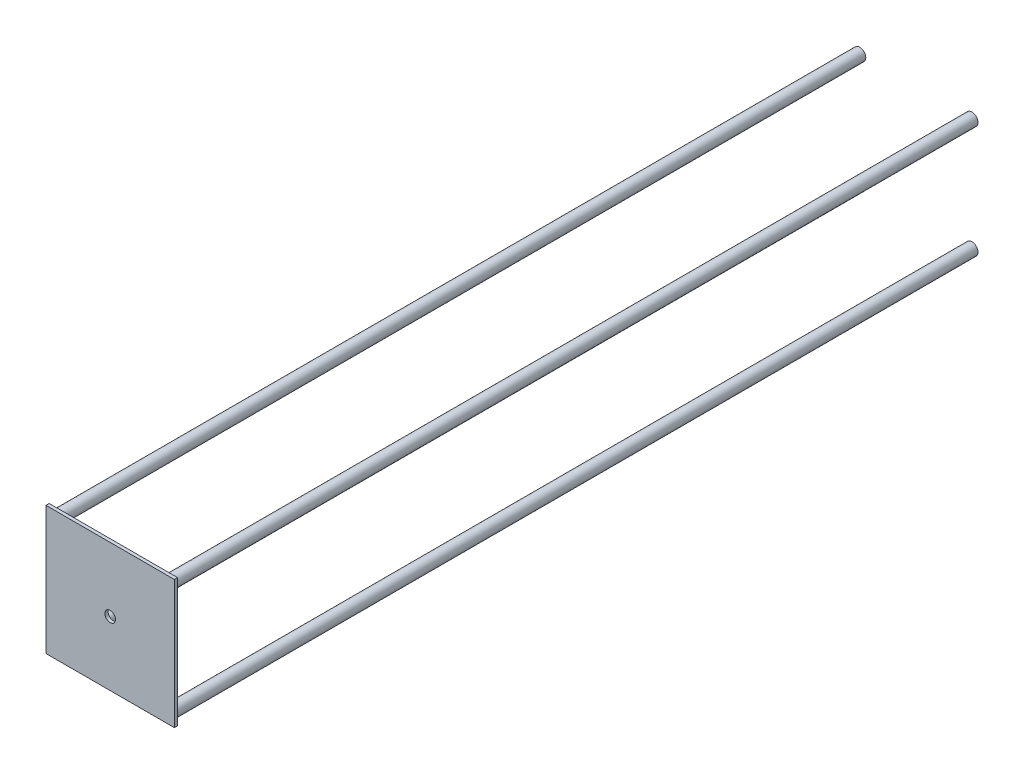
ISO-10303-21;
HEADER;
FILE_DESCRIPTION(('STEP AP214'),'2;1');
FILE_NAME('part.step','',(''),(''),'','','');
FILE_SCHEMA(('AUTOMOTIVE_DESIGN { 1 0 10303 214 1 1 1 1 }'));
ENDSEC;
DATA;
#1=APPLICATION_CONTEXT('core data for automotive mechanical design processes');
#2=APPLICATION_PROTOCOL_DEFINITION('international standard','automotive_design',2000,#1);
#3=PRODUCT_CONTEXT('',#1,'mechanical');
#4=PRODUCT('Part','Part','',(#3));
#5=PRODUCT_RELATED_PRODUCT_CATEGORY('part','',(#4));
#6=PRODUCT_DEFINITION_FORMATION('','',#4);
#7=PRODUCT_DEFINITION_CONTEXT('part definition',#1,'design');
#8=PRODUCT_DEFINITION('design','',#6,#7);
#9=PRODUCT_DEFINITION_SHAPE('','',#8);
#10=(LENGTH_UNIT() NAMED_UNIT(*) SI_UNIT(.MILLI.,.METRE.));
#11=(NAMED_UNIT(*) PLANE_ANGLE_UNIT() SI_UNIT($,.RADIAN.));
#12=(NAMED_UNIT(*) SI_UNIT($,.STERADIAN.) SOLID_ANGLE_UNIT());
#13=UNCERTAINTY_MEASURE_WITH_UNIT(LENGTH_MEASURE(1.E-05),#10,'distance_accuracy_value','');
#14=(GEOMETRIC_REPRESENTATION_CONTEXT(3) GLOBAL_UNCERTAINTY_ASSIGNED_CONTEXT((#13)) GLOBAL_UNIT_ASSIGNED_CONTEXT((#10,
#11,#12)) REPRESENTATION_CONTEXT('',''));
#15=CARTESIAN_POINT('',(0.,0.,0.));
#16=DIRECTION('',(0.,0.,1.));
#17=DIRECTION('',(1.,0.,0.));
#18=AXIS2_PLACEMENT_3D('',#15,#16,#17);
#19=CARTESIAN_POINT('',(50.8,-50.8,2.54));
#20=DIRECTION('',(-1.,0.,0.));
#21=DIRECTION('',(0.,0.,1.));
#22=AXIS2_PLACEMENT_3D('',#19,#20,#21);
#23=PLANE('',#22);
#24=DIRECTION('',(0.,1.,0.));
#25=VECTOR('',#24,1.);
#26=CARTESIAN_POINT('',(50.8,-50.8,0.));
#27=LINE('',#26,#25);
#28=CARTESIAN_POINT('',(50.8,-50.8,0.));
#29=VERTEX_POINT('',#28);
#30=CARTESIAN_POINT('',(50.8,50.8,0.));
#31=VERTEX_POINT('',#30);
#32=EDGE_CURVE('E98',#29,#31,#27,.T.);
#33=ORIENTED_EDGE('',*,*,#32,.T.);
#34=DIRECTION('',(0.,0.,-1.));
#35=VECTOR('',#34,1.);
#36=CARTESIAN_POINT('',(50.8,50.8,2.54));
#37=LINE('',#36,#35);
#38=CARTESIAN_POINT('',(50.8,50.8,2.54));
#39=VERTEX_POINT('',#38);
#40=EDGE_CURVE('E11',#39,#31,#37,.T.);
#41=ORIENTED_EDGE('',*,*,#40,.F.);
#42=DIRECTION('',(0.,1.,0.));
#43=VECTOR('',#42,1.);
#44=CARTESIAN_POINT('',(50.8,-50.8,2.54));
#45=LINE('',#44,#43);
#46=CARTESIAN_POINT('',(50.8,-50.8,2.54));
#47=VERTEX_POINT('',#46);
#48=EDGE_CURVE('E85',#47,#39,#45,.T.);
#49=ORIENTED_EDGE('',*,*,#48,.F.);
#50=DIRECTION('',(0.,0.,-1.));
#51=VECTOR('',#50,1.);
#52=CARTESIAN_POINT('',(50.8,-50.8,2.54));
#53=LINE('',#52,#51);
#54=EDGE_CURVE('E94',#47,#29,#53,.T.);
#55=ORIENTED_EDGE('',*,*,#54,.T.);
#56=EDGE_LOOP('',(#33,#41,#49,#55));
#57=FACE_BOUND('',#56,.T.);
#58=ADVANCED_FACE('F33',(#57),#23,.F.);
#59=CARTESIAN_POINT('',(-50.8,50.8,2.54));
#60=DIRECTION('',(0.,-1.,0.));
#61=DIRECTION('',(0.,0.,-1.));
#62=AXIS2_PLACEMENT_3D('',#59,#60,#61);
#63=PLANE('',#62);
#64=DIRECTION('',(-1.,0.,0.));
#65=VECTOR('',#64,1.);
#66=CARTESIAN_POINT('',(-50.8,50.8,0.));
#67=LINE('',#66,#65);
#68=CARTESIAN_POINT('',(-50.8,50.8,0.));
#69=VERTEX_POINT('',#68);
#70=EDGE_CURVE('E89',#31,#69,#67,.T.);
#71=ORIENTED_EDGE('',*,*,#70,.T.);
#72=DIRECTION('',(0.,0.,-1.));
#73=VECTOR('',#72,1.);
#74=CARTESIAN_POINT('',(-50.8,50.8,2.54));
#75=LINE('',#74,#73);
#76=CARTESIAN_POINT('',(-50.8,50.8,2.54));
#77=VERTEX_POINT('',#76);
#78=EDGE_CURVE('E42',#77,#69,#75,.T.);
#79=ORIENTED_EDGE('',*,*,#78,.F.);
#80=DIRECTION('',(-1.,0.,0.));
#81=VECTOR('',#80,1.);
#82=CARTESIAN_POINT('',(-50.8,50.8,2.54));
#83=LINE('',#82,#81);
#84=EDGE_CURVE('E80',#39,#77,#83,.T.);
#85=ORIENTED_EDGE('',*,*,#84,.F.);
#86=ORIENTED_EDGE('',*,*,#40,.T.);
#87=EDGE_LOOP('',(#71,#79,#85,#86));
#88=FACE_BOUND('',#87,.T.);
#89=ADVANCED_FACE('F88',(#88),#63,.F.);
#90=CARTESIAN_POINT('',(-50.8,-50.8,2.54));
#91=DIRECTION('',(1.,0.,0.));
#92=DIRECTION('',(0.,0.,-1.));
#93=AXIS2_PLACEMENT_3D('',#90,#91,#92);
#94=PLANE('',#93);
#95=DIRECTION('',(0.,-1.,0.));
#96=VECTOR('',#95,1.);
#97=CARTESIAN_POINT('',(-50.8,-50.8,0.));
#98=LINE('',#97,#96);
#99=CARTESIAN_POINT('',(-50.8,-50.8,0.));
#100=VERTEX_POINT('',#99);
#101=EDGE_CURVE('E67',#69,#100,#98,.T.);
#102=ORIENTED_EDGE('',*,*,#101,.T.);
#103=DIRECTION('',(0.,0.,-1.));
#104=VECTOR('',#103,1.);
#105=CARTESIAN_POINT('',(-50.8,-50.8,2.54));
#106=LINE('',#105,#104);
#107=CARTESIAN_POINT('',(-50.8,-50.8,2.54));
#108=VERTEX_POINT('',#107);
#109=EDGE_CURVE('E90',#108,#100,#106,.T.);
#110=ORIENTED_EDGE('',*,*,#109,.F.);
#111=DIRECTION('',(0.,-1.,0.));
#112=VECTOR('',#111,1.);
#113=CARTESIAN_POINT('',(-50.8,-50.8,2.54));
#114=LINE('',#113,#112);
#115=EDGE_CURVE('E83',#77,#108,#114,.T.);
#116=ORIENTED_EDGE('',*,*,#115,.F.);
#117=ORIENTED_EDGE('',*,*,#78,.T.);
#118=EDGE_LOOP('',(#102,#110,#116,#117));
#119=FACE_BOUND('',#118,.T.);
#120=ADVANCED_FACE('F92',(#119),#94,.F.);
#121=CARTESIAN_POINT('',(-50.8,-50.8,2.54));
#122=DIRECTION('',(0.,1.,0.));
#123=DIRECTION('',(0.,0.,1.));
#124=AXIS2_PLACEMENT_3D('',#121,#122,#123);
#125=PLANE('',#124);
#126=DIRECTION('',(1.,0.,0.));
#127=VECTOR('',#126,1.);
#128=CARTESIAN_POINT('',(-50.8,-50.8,0.));
#129=LINE('',#128,#127);
#130=EDGE_CURVE('E73',#100,#29,#129,.T.);
#131=ORIENTED_EDGE('',*,*,#130,.T.);
#132=ORIENTED_EDGE('',*,*,#54,.F.);
#133=DIRECTION('',(1.,0.,0.));
#134=VECTOR('',#133,1.);
#135=CARTESIAN_POINT('',(-50.8,-50.8,2.54));
#136=LINE('',#135,#134);
#137=EDGE_CURVE('E50',#108,#47,#136,.T.);
#138=ORIENTED_EDGE('',*,*,#137,.F.);
#139=ORIENTED_EDGE('',*,*,#109,.T.);
#140=EDGE_LOOP('',(#131,#132,#138,#139));
#141=FACE_BOUND('',#140,.T.);
#142=ADVANCED_FACE('F106',(#141),#125,.F.);
#143=CARTESIAN_POINT('',(0.,0.,2.54));
#144=DIRECTION('',(0.,0.,-1.));
#145=DIRECTION('',(-1.,0.,0.));
#146=AXIS2_PLACEMENT_3D('',#143,#144,#145);
#147=PLANE('',#146);
#148=CARTESIAN_POINT('',(0.,0.,2.54));
#149=DIRECTION('',(0.,0.,1.));
#150=DIRECTION('',(1.,0.,0.));
#151=AXIS2_PLACEMENT_3D('',#148,#149,#150);
#152=CIRCLE('',#151,4.191);
#153=CARTESIAN_POINT('',(4.191,0.,2.54));
#154=VERTEX_POINT('',#153);
#155=EDGE_CURVE('E135',#154,#154,#152,.T.);
#156=ORIENTED_EDGE('',*,*,#155,.F.);
#157=EDGE_LOOP('',(#156));
#158=FACE_BOUND('',#157,.T.);
#159=ORIENTED_EDGE('',*,*,#48,.T.);
#160=ORIENTED_EDGE('',*,*,#84,.T.);
#161=ORIENTED_EDGE('',*,*,#115,.T.);
#162=ORIENTED_EDGE('',*,*,#137,.T.);
#163=EDGE_LOOP('',(#159,#160,#161,#162));
#164=FACE_BOUND('',#163,.T.);
#165=ADVANCED_FACE('F81',(#158,#164),#147,.F.);
#166=CARTESIAN_POINT('',(0.,0.,0.));
#167=DIRECTION('',(0.,0.,-1.));
#168=DIRECTION('',(-1.,0.,0.));
#169=AXIS2_PLACEMENT_3D('',#166,#167,#168);
#170=PLANE('',#169);
#171=CARTESIAN_POINT('',(0.,0.,0.));
#172=DIRECTION('',(0.,0.,-1.));
#173=DIRECTION('',(-1.,0.,0.));
#174=AXIS2_PLACEMENT_3D('',#171,#172,#173);
#175=CIRCLE('',#174,4.191);
#176=CARTESIAN_POINT('',(-4.191,0.,0.));
#177=VERTEX_POINT('',#176);
#178=EDGE_CURVE('E36',#177,#177,#175,.T.);
#179=ORIENTED_EDGE('',*,*,#178,.F.);
#180=EDGE_LOOP('',(#179));
#181=FACE_BOUND('',#180,.T.);
#182=CARTESIAN_POINT('',(-44.3772909723315,44.45,0.));
#183=DIRECTION('',(0.,0.,-1.));
#184=DIRECTION('',(-1.,0.,0.));
#185=AXIS2_PLACEMENT_3D('',#182,#183,#184);
#186=CIRCLE('',#185,4.826);
#187=CARTESIAN_POINT('',(-49.2032909723314,44.45,0.));
#188=VERTEX_POINT('',#187);
#189=EDGE_CURVE('E127',#188,#188,#186,.T.);
#190=ORIENTED_EDGE('',*,*,#189,.F.);
#191=EDGE_LOOP('',(#190));
#192=FACE_BOUND('',#191,.T.);
#193=CARTESIAN_POINT('',(44.45,44.45,0.));
#194=DIRECTION('',(0.,0.,-1.));
#195=DIRECTION('',(-1.,0.,0.));
#196=AXIS2_PLACEMENT_3D('',#193,#194,#195);
#197=CIRCLE('',#196,4.826);
#198=CARTESIAN_POINT('',(39.624,44.45,0.));
#199=VERTEX_POINT('',#198);
#200=EDGE_CURVE('E121',#199,#199,#197,.T.);
#201=ORIENTED_EDGE('',*,*,#200,.F.);
#202=EDGE_LOOP('',(#201));
#203=FACE_BOUND('',#202,.T.);
#204=CARTESIAN_POINT('',(44.45,-44.45,0.));
#205=DIRECTION('',(0.,0.,-1.));
#206=DIRECTION('',(-1.,0.,0.));
#207=AXIS2_PLACEMENT_3D('',#204,#205,#206);
#208=CIRCLE('',#207,4.826);
#209=CARTESIAN_POINT('',(39.624,-44.45,0.));
#210=VERTEX_POINT('',#209);
#211=EDGE_CURVE('E115',#210,#210,#208,.T.);
#212=ORIENTED_EDGE('',*,*,#211,.F.);
#213=EDGE_LOOP('',(#212));
#214=FACE_BOUND('',#213,.T.);
#215=CARTESIAN_POINT('',(-44.3772909723315,-44.45,0.));
#216=DIRECTION('',(0.,0.,-1.));
#217=DIRECTION('',(-1.,0.,0.));
#218=AXIS2_PLACEMENT_3D('',#215,#216,#217);
#219=CIRCLE('',#218,4.826);
#220=CARTESIAN_POINT('',(-49.2032909723314,-44.45,0.));
#221=VERTEX_POINT('',#220);
#222=EDGE_CURVE('E112',#221,#221,#219,.T.);
#223=ORIENTED_EDGE('',*,*,#222,.F.);
#224=EDGE_LOOP('',(#223));
#225=FACE_BOUND('',#224,.T.);
#226=ORIENTED_EDGE('',*,*,#32,.F.);
#227=ORIENTED_EDGE('',*,*,#130,.F.);
#228=ORIENTED_EDGE('',*,*,#101,.F.);
#229=ORIENTED_EDGE('',*,*,#70,.F.);
#230=EDGE_LOOP('',(#226,#227,#228,#229));
#231=FACE_BOUND('',#230,.T.);
#232=ADVANCED_FACE('F109',(#181,#192,#203,#214,#225,#231),#170,.T.);
#233=CARTESIAN_POINT('',(-44.3772909723315,-44.45,-635.));
#234=DIRECTION('',(0.,0.,1.));
#235=DIRECTION('',(1.,0.,0.));
#236=AXIS2_PLACEMENT_3D('',#233,#234,#235);
#237=CYLINDRICAL_SURFACE('',#236,4.826);
#238=CARTESIAN_POINT('',(-44.3772909723315,-44.45,-635.));
#239=DIRECTION('',(0.,0.,-1.));
#240=DIRECTION('',(-1.,0.,0.));
#241=AXIS2_PLACEMENT_3D('',#238,#239,#240);
#242=CIRCLE('',#241,4.826);
#243=CARTESIAN_POINT('',(-49.2032909723314,-44.45,-635.));
#244=VERTEX_POINT('',#243);
#245=EDGE_CURVE('E101',#244,#244,#242,.T.);
#246=ORIENTED_EDGE('',*,*,#245,.F.);
#247=EDGE_LOOP('',(#246));
#248=FACE_BOUND('',#247,.T.);
#249=ORIENTED_EDGE('',*,*,#222,.T.);
#250=EDGE_LOOP('',(#249));
#251=FACE_BOUND('',#250,.T.);
#252=ADVANCED_FACE('F146',(#248,#251),#237,.T.);
#253=CARTESIAN_POINT('',(-44.3772909723315,-44.45,-635.));
#254=DIRECTION('',(0.,0.,-1.));
#255=DIRECTION('',(-1.,0.,0.));
#256=AXIS2_PLACEMENT_3D('',#253,#254,#255);
#257=PLANE('',#256);
#258=ORIENTED_EDGE('',*,*,#245,.T.);
#259=EDGE_LOOP('',(#258));
#260=FACE_BOUND('',#259,.T.);
#261=ADVANCED_FACE('F157',(#260),#257,.T.);
#262=CARTESIAN_POINT('',(44.45,-44.45,-635.));
#263=DIRECTION('',(0.,0.,1.));
#264=DIRECTION('',(1.,0.,0.));
#265=AXIS2_PLACEMENT_3D('',#262,#263,#264);
#266=CYLINDRICAL_SURFACE('',#265,4.826);
#267=CARTESIAN_POINT('',(44.45,-44.45,-635.));
#268=DIRECTION('',(0.,0.,-1.));
#269=DIRECTION('',(-1.,0.,0.));
#270=AXIS2_PLACEMENT_3D('',#267,#268,#269);
#271=CIRCLE('',#270,4.826);
#272=CARTESIAN_POINT('',(39.624,-44.45,-635.));
#273=VERTEX_POINT('',#272);
#274=EDGE_CURVE('E118',#273,#273,#271,.T.);
#275=ORIENTED_EDGE('',*,*,#274,.F.);
#276=EDGE_LOOP('',(#275));
#277=FACE_BOUND('',#276,.T.);
#278=ORIENTED_EDGE('',*,*,#211,.T.);
#279=EDGE_LOOP('',(#278));
#280=FACE_BOUND('',#279,.T.);
#281=ADVANCED_FACE('F163',(#277,#280),#266,.T.);
#282=CARTESIAN_POINT('',(44.45,-44.45,-635.));
#283=DIRECTION('',(0.,0.,-1.));
#284=DIRECTION('',(-1.,0.,0.));
#285=AXIS2_PLACEMENT_3D('',#282,#283,#284);
#286=PLANE('',#285);
#287=ORIENTED_EDGE('',*,*,#274,.T.);
#288=EDGE_LOOP('',(#287));
#289=FACE_BOUND('',#288,.T.);
#290=ADVANCED_FACE('F230',(#289),#286,.T.);
#291=CARTESIAN_POINT('',(44.45,44.45,-635.));
#292=DIRECTION('',(0.,0.,1.));
#293=DIRECTION('',(1.,0.,0.));
#294=AXIS2_PLACEMENT_3D('',#291,#292,#293);
#295=CYLINDRICAL_SURFACE('',#294,4.826);
#296=CARTESIAN_POINT('',(44.45,44.45,-635.));
#297=DIRECTION('',(0.,0.,-1.));
#298=DIRECTION('',(-1.,0.,0.));
#299=AXIS2_PLACEMENT_3D('',#296,#297,#298);
#300=CIRCLE('',#299,4.826);
#301=CARTESIAN_POINT('',(39.624,44.45,-635.));
#302=VERTEX_POINT('',#301);
#303=EDGE_CURVE('E124',#302,#302,#300,.T.);
#304=ORIENTED_EDGE('',*,*,#303,.F.);
#305=EDGE_LOOP('',(#304));
#306=FACE_BOUND('',#305,.T.);
#307=ORIENTED_EDGE('',*,*,#200,.T.);
#308=EDGE_LOOP('',(#307));
#309=FACE_BOUND('',#308,.T.);
#310=ADVANCED_FACE('F222',(#306,#309),#295,.T.);
#311=CARTESIAN_POINT('',(44.45,44.45,-635.));
#312=DIRECTION('',(0.,0.,-1.));
#313=DIRECTION('',(-1.,0.,0.));
#314=AXIS2_PLACEMENT_3D('',#311,#312,#313);
#315=PLANE('',#314);
#316=ORIENTED_EDGE('',*,*,#303,.T.);
#317=EDGE_LOOP('',(#316));
#318=FACE_BOUND('',#317,.T.);
#319=ADVANCED_FACE('F214',(#318),#315,.T.);
#320=CARTESIAN_POINT('',(-44.3772909723315,44.45,-635.));
#321=DIRECTION('',(0.,0.,1.));
#322=DIRECTION('',(1.,0.,0.));
#323=AXIS2_PLACEMENT_3D('',#320,#321,#322);
#324=CYLINDRICAL_SURFACE('',#323,4.826);
#325=CARTESIAN_POINT('',(-44.3772909723315,44.45,-635.));
#326=DIRECTION('',(0.,0.,-1.));
#327=DIRECTION('',(-1.,0.,0.));
#328=AXIS2_PLACEMENT_3D('',#325,#326,#327);
#329=CIRCLE('',#328,4.826);
#330=CARTESIAN_POINT('',(-49.2032909723314,44.45,-635.));
#331=VERTEX_POINT('',#330);
#332=EDGE_CURVE('E130',#331,#331,#329,.T.);
#333=ORIENTED_EDGE('',*,*,#332,.F.);
#334=EDGE_LOOP('',(#333));
#335=FACE_BOUND('',#334,.T.);
#336=ORIENTED_EDGE('',*,*,#189,.T.);
#337=EDGE_LOOP('',(#336));
#338=FACE_BOUND('',#337,.T.);
#339=ADVANCED_FACE('F207',(#335,#338),#324,.T.);
#340=CARTESIAN_POINT('',(-44.3772909723315,44.45,-635.));
#341=DIRECTION('',(0.,0.,-1.));
#342=DIRECTION('',(-1.,0.,0.));
#343=AXIS2_PLACEMENT_3D('',#340,#341,#342);
#344=PLANE('',#343);
#345=ORIENTED_EDGE('',*,*,#332,.T.);
#346=EDGE_LOOP('',(#345));
#347=FACE_BOUND('',#346,.T.);
#348=ADVANCED_FACE('F198',(#347),#344,.T.);
#349=CARTESIAN_POINT('',(0.,0.,-632.46));
#350=DIRECTION('',(0.,0.,1.));
#351=DIRECTION('',(1.,0.,0.));
#352=AXIS2_PLACEMENT_3D('',#349,#350,#351);
#353=CYLINDRICAL_SURFACE('',#352,4.191);
#354=ORIENTED_EDGE('',*,*,#178,.T.);
#355=EDGE_LOOP('',(#354));
#356=FACE_BOUND('',#355,.T.);
#357=ORIENTED_EDGE('',*,*,#155,.T.);
#358=EDGE_LOOP('',(#357));
#359=FACE_BOUND('',#358,.T.);
#360=ADVANCED_FACE('F142',(#356,#359),#353,.F.);
#361=CLOSED_SHELL('',(#58,#89,#120,#142,#165,#232,#252,#261,#281,#290,#310,#319,#339,#348,#360));
#362=MANIFOLD_SOLID_BREP('B2',#361);
#363=ADVANCED_BREP_SHAPE_REPRESENTATION('',(#18,#362),#14);
#364=SHAPE_DEFINITION_REPRESENTATION(#9,#363);
ENDSEC;
END-ISO-10303-21;
